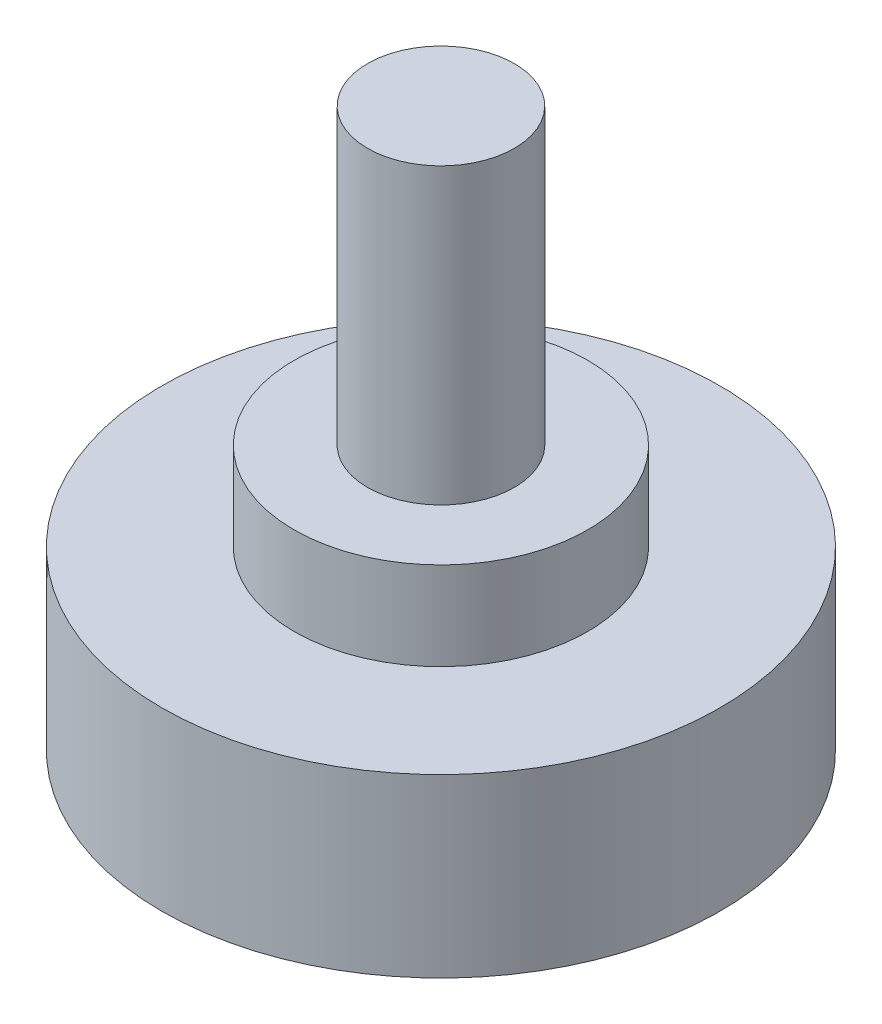
ISO-10303-21;
HEADER;
FILE_DESCRIPTION(('STEP AP214'),'2;1');
FILE_NAME('part.step','',(''),(''),'','','');
FILE_SCHEMA(('AUTOMOTIVE_DESIGN { 1 0 10303 214 1 1 1 1 }'));
ENDSEC;
DATA;
#1=APPLICATION_CONTEXT('core data for automotive mechanical design processes');
#2=APPLICATION_PROTOCOL_DEFINITION('international standard','automotive_design',2000,#1);
#3=PRODUCT_CONTEXT('',#1,'mechanical');
#4=PRODUCT('Part','Part','',(#3));
#5=PRODUCT_RELATED_PRODUCT_CATEGORY('part','',(#4));
#6=PRODUCT_DEFINITION_FORMATION('','',#4);
#7=PRODUCT_DEFINITION_CONTEXT('part definition',#1,'design');
#8=PRODUCT_DEFINITION('design','',#6,#7);
#9=PRODUCT_DEFINITION_SHAPE('','',#8);
#10=(LENGTH_UNIT() NAMED_UNIT(*) SI_UNIT(.MILLI.,.METRE.));
#11=(NAMED_UNIT(*) PLANE_ANGLE_UNIT() SI_UNIT($,.RADIAN.));
#12=(NAMED_UNIT(*) SI_UNIT($,.STERADIAN.) SOLID_ANGLE_UNIT());
#13=UNCERTAINTY_MEASURE_WITH_UNIT(LENGTH_MEASURE(1.E-05),#10,'distance_accuracy_value','');
#14=(GEOMETRIC_REPRESENTATION_CONTEXT(3) GLOBAL_UNCERTAINTY_ASSIGNED_CONTEXT((#13)) GLOBAL_UNIT_ASSIGNED_CONTEXT((#10,
#11,#12)) REPRESENTATION_CONTEXT('',''));
#15=CARTESIAN_POINT('',(0.,0.,0.));
#16=DIRECTION('',(0.,0.,1.));
#17=DIRECTION('',(1.,0.,0.));
#18=AXIS2_PLACEMENT_3D('',#15,#16,#17);
#19=CARTESIAN_POINT('',(0.,12.,0.));
#20=DIRECTION('',(0.,-1.,0.));
#21=DIRECTION('',(0.,0.,-1.));
#22=AXIS2_PLACEMENT_3D('',#19,#20,#21);
#23=CYLINDRICAL_SURFACE('',#22,19.);
#24=CARTESIAN_POINT('',(0.,12.,0.));
#25=DIRECTION('',(0.,1.,0.));
#26=DIRECTION('',(0.,0.,1.));
#27=AXIS2_PLACEMENT_3D('',#24,#25,#26);
#28=CIRCLE('',#27,19.);
#29=CARTESIAN_POINT('',(0.,12.,19.));
#30=VERTEX_POINT('',#29);
#31=EDGE_CURVE('E51',#30,#30,#28,.T.);
#32=ORIENTED_EDGE('',*,*,#31,.F.);
#33=EDGE_LOOP('',(#32));
#34=FACE_BOUND('',#33,.T.);
#35=CARTESIAN_POINT('',(0.,0.,0.));
#36=DIRECTION('',(0.,1.,0.));
#37=DIRECTION('',(0.,0.,1.));
#38=AXIS2_PLACEMENT_3D('',#35,#36,#37);
#39=CIRCLE('',#38,19.);
#40=CARTESIAN_POINT('',(0.,0.,19.));
#41=VERTEX_POINT('',#40);
#42=EDGE_CURVE('E40',#41,#41,#39,.T.);
#43=ORIENTED_EDGE('',*,*,#42,.T.);
#44=EDGE_LOOP('',(#43));
#45=FACE_BOUND('',#44,.T.);
#46=ADVANCED_FACE('F37',(#34,#45),#23,.T.);
#47=CARTESIAN_POINT('',(0.,12.,0.));
#48=DIRECTION('',(0.,1.,0.));
#49=DIRECTION('',(0.,0.,1.));
#50=AXIS2_PLACEMENT_3D('',#47,#48,#49);
#51=PLANE('',#50);
#52=CARTESIAN_POINT('',(0.,12.,0.));
#53=DIRECTION('',(0.,1.,0.));
#54=DIRECTION('',(0.,0.,1.));
#55=AXIS2_PLACEMENT_3D('',#52,#53,#54);
#56=CIRCLE('',#55,10.);
#57=CARTESIAN_POINT('',(0.,12.,10.));
#58=VERTEX_POINT('',#57);
#59=EDGE_CURVE('E45',#58,#58,#56,.T.);
#60=ORIENTED_EDGE('',*,*,#59,.F.);
#61=EDGE_LOOP('',(#60));
#62=FACE_BOUND('',#61,.T.);
#63=ORIENTED_EDGE('',*,*,#31,.T.);
#64=EDGE_LOOP('',(#63));
#65=FACE_BOUND('',#64,.T.);
#66=ADVANCED_FACE('F71',(#62,#65),#51,.T.);
#67=CARTESIAN_POINT('',(0.,0.,0.));
#68=DIRECTION('',(0.,1.,0.));
#69=DIRECTION('',(0.,0.,1.));
#70=AXIS2_PLACEMENT_3D('',#67,#68,#69);
#71=PLANE('',#70);
#72=ORIENTED_EDGE('',*,*,#42,.F.);
#73=EDGE_LOOP('',(#72));
#74=FACE_BOUND('',#73,.T.);
#75=ADVANCED_FACE('F68',(#74),#71,.F.);
#76=CARTESIAN_POINT('',(0.,18.,0.));
#77=DIRECTION('',(0.,-1.,0.));
#78=DIRECTION('',(0.,0.,-1.));
#79=AXIS2_PLACEMENT_3D('',#76,#77,#78);
#80=CYLINDRICAL_SURFACE('',#79,10.);
#81=CARTESIAN_POINT('',(0.,18.,0.));
#82=DIRECTION('',(0.,1.,0.));
#83=DIRECTION('',(0.,0.,1.));
#84=AXIS2_PLACEMENT_3D('',#81,#82,#83);
#85=CIRCLE('',#84,10.);
#86=CARTESIAN_POINT('',(0.,18.,10.));
#87=VERTEX_POINT('',#86);
#88=EDGE_CURVE('E56',#87,#87,#85,.T.);
#89=ORIENTED_EDGE('',*,*,#88,.F.);
#90=EDGE_LOOP('',(#89));
#91=FACE_BOUND('',#90,.T.);
#92=ORIENTED_EDGE('',*,*,#59,.T.);
#93=EDGE_LOOP('',(#92));
#94=FACE_BOUND('',#93,.T.);
#95=ADVANCED_FACE('F70',(#91,#94),#80,.T.);
#96=CARTESIAN_POINT('',(0.,18.,0.));
#97=DIRECTION('',(0.,1.,0.));
#98=DIRECTION('',(0.,0.,1.));
#99=AXIS2_PLACEMENT_3D('',#96,#97,#98);
#100=PLANE('',#99);
#101=CARTESIAN_POINT('',(0.,18.,0.));
#102=DIRECTION('',(0.,1.,0.));
#103=DIRECTION('',(0.,0.,1.));
#104=AXIS2_PLACEMENT_3D('',#101,#102,#103);
#105=CIRCLE('',#104,5.);
#106=CARTESIAN_POINT('',(0.,18.,5.));
#107=VERTEX_POINT('',#106);
#108=EDGE_CURVE('E10',#107,#107,#105,.T.);
#109=ORIENTED_EDGE('',*,*,#108,.F.);
#110=EDGE_LOOP('',(#109));
#111=FACE_BOUND('',#110,.T.);
#112=ORIENTED_EDGE('',*,*,#88,.T.);
#113=EDGE_LOOP('',(#112));
#114=FACE_BOUND('',#113,.T.);
#115=ADVANCED_FACE('F76',(#111,#114),#100,.T.);
#116=CARTESIAN_POINT('',(0.,38.,0.));
#117=DIRECTION('',(0.,-1.,0.));
#118=DIRECTION('',(0.,0.,-1.));
#119=AXIS2_PLACEMENT_3D('',#116,#117,#118);
#120=CYLINDRICAL_SURFACE('',#119,5.);
#121=CARTESIAN_POINT('',(0.,38.,0.));
#122=DIRECTION('',(0.,1.,0.));
#123=DIRECTION('',(0.,0.,1.));
#124=AXIS2_PLACEMENT_3D('',#121,#122,#123);
#125=CIRCLE('',#124,5.);
#126=CARTESIAN_POINT('',(0.,38.,5.));
#127=VERTEX_POINT('',#126);
#128=EDGE_CURVE('E55',#127,#127,#125,.T.);
#129=ORIENTED_EDGE('',*,*,#128,.F.);
#130=EDGE_LOOP('',(#129));
#131=FACE_BOUND('',#130,.T.);
#132=ORIENTED_EDGE('',*,*,#108,.T.);
#133=EDGE_LOOP('',(#132));
#134=FACE_BOUND('',#133,.T.);
#135=ADVANCED_FACE('F106',(#131,#134),#120,.T.);
#136=CARTESIAN_POINT('',(0.,38.,0.));
#137=DIRECTION('',(0.,1.,0.));
#138=DIRECTION('',(0.,0.,1.));
#139=AXIS2_PLACEMENT_3D('',#136,#137,#138);
#140=PLANE('',#139);
#141=ORIENTED_EDGE('',*,*,#128,.T.);
#142=EDGE_LOOP('',(#141));
#143=FACE_BOUND('',#142,.T.);
#144=ADVANCED_FACE('F116',(#143),#140,.T.);
#145=CLOSED_SHELL('',(#46,#66,#75,#95,#115,#135,#144));
#146=MANIFOLD_SOLID_BREP('B2',#145);
#147=ADVANCED_BREP_SHAPE_REPRESENTATION('',(#18,#146),#14);
#148=SHAPE_DEFINITION_REPRESENTATION(#9,#147);
ENDSEC;
END-ISO-10303-21;
